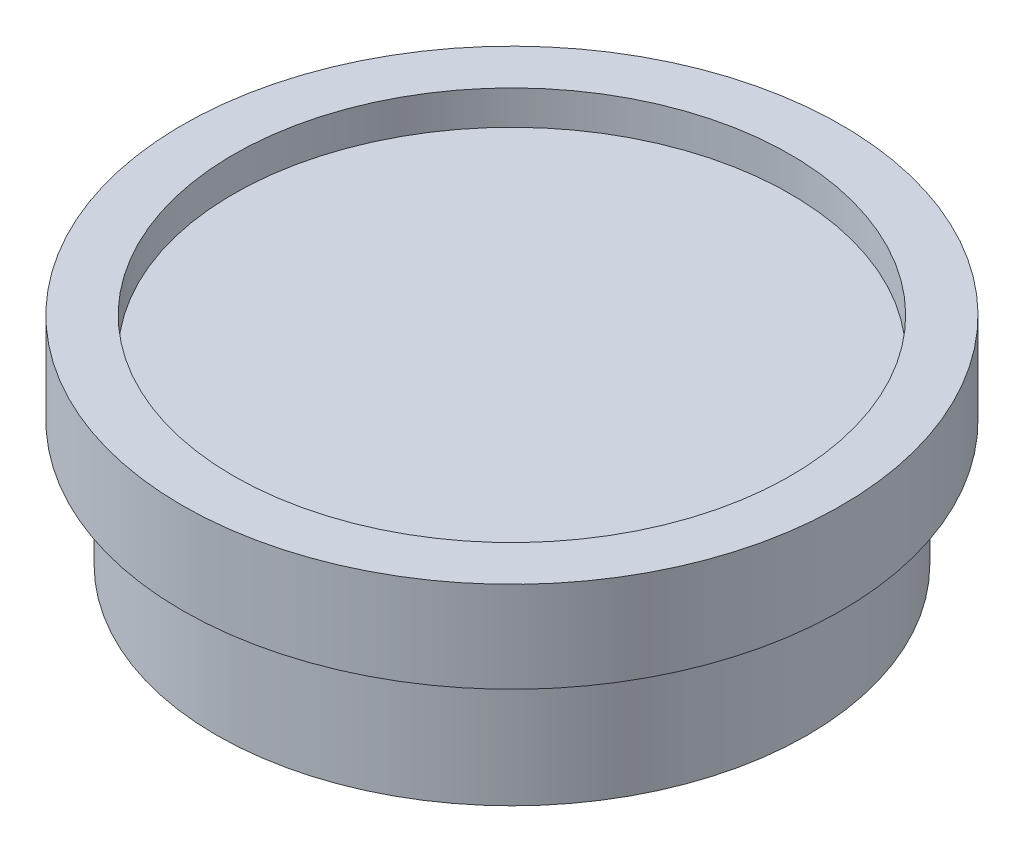
ISO-10303-21;
HEADER;
FILE_DESCRIPTION(('STEP AP214'),'2;1');
FILE_NAME('part.step','',(''),(''),'','','');
FILE_SCHEMA(('AUTOMOTIVE_DESIGN { 1 0 10303 214 1 1 1 1 }'));
ENDSEC;
DATA;
#1=APPLICATION_CONTEXT('core data for automotive mechanical design processes');
#2=APPLICATION_PROTOCOL_DEFINITION('international standard','automotive_design',2000,#1);
#3=PRODUCT_CONTEXT('',#1,'mechanical');
#4=PRODUCT('Part','Part','',(#3));
#5=PRODUCT_RELATED_PRODUCT_CATEGORY('part','',(#4));
#6=PRODUCT_DEFINITION_FORMATION('','',#4);
#7=PRODUCT_DEFINITION_CONTEXT('part definition',#1,'design');
#8=PRODUCT_DEFINITION('design','',#6,#7);
#9=PRODUCT_DEFINITION_SHAPE('','',#8);
#10=(LENGTH_UNIT() NAMED_UNIT(*) SI_UNIT(.MILLI.,.METRE.));
#11=(NAMED_UNIT(*) PLANE_ANGLE_UNIT() SI_UNIT($,.RADIAN.));
#12=(NAMED_UNIT(*) SI_UNIT($,.STERADIAN.) SOLID_ANGLE_UNIT());
#13=UNCERTAINTY_MEASURE_WITH_UNIT(LENGTH_MEASURE(1.E-05),#10,'distance_accuracy_value','');
#14=(GEOMETRIC_REPRESENTATION_CONTEXT(3) GLOBAL_UNCERTAINTY_ASSIGNED_CONTEXT((#13)) GLOBAL_UNIT_ASSIGNED_CONTEXT((#10,
#11,#12)) REPRESENTATION_CONTEXT('',''));
#15=CARTESIAN_POINT('',(0.,0.,0.));
#16=DIRECTION('',(0.,0.,1.));
#17=DIRECTION('',(1.,0.,0.));
#18=AXIS2_PLACEMENT_3D('',#15,#16,#17);
#19=CARTESIAN_POINT('',(0.,-8.,0.));
#20=DIRECTION('',(0.,1.,0.));
#21=DIRECTION('',(0.,0.,1.));
#22=AXIS2_PLACEMENT_3D('',#19,#20,#21);
#23=CYLINDRICAL_SURFACE('',#22,29.);
#24=CARTESIAN_POINT('',(0.,-8.,0.));
#25=DIRECTION('',(0.,1.,0.));
#26=DIRECTION('',(0.,0.,1.));
#27=AXIS2_PLACEMENT_3D('',#24,#25,#26);
#28=CIRCLE('',#27,29.);
#29=CARTESIAN_POINT('',(0.,-8.,29.));
#30=VERTEX_POINT('',#29);
#31=EDGE_CURVE('E41',#30,#30,#28,.T.);
#32=ORIENTED_EDGE('',*,*,#31,.T.);
#33=EDGE_LOOP('',(#32));
#34=FACE_BOUND('',#33,.T.);
#35=CARTESIAN_POINT('',(0.,0.,0.));
#36=DIRECTION('',(0.,1.,0.));
#37=DIRECTION('',(0.,0.,1.));
#38=AXIS2_PLACEMENT_3D('',#35,#36,#37);
#39=CIRCLE('',#38,29.);
#40=CARTESIAN_POINT('',(0.,0.,29.));
#41=VERTEX_POINT('',#40);
#42=EDGE_CURVE('E45',#41,#41,#39,.T.);
#43=ORIENTED_EDGE('',*,*,#42,.F.);
#44=EDGE_LOOP('',(#43));
#45=FACE_BOUND('',#44,.T.);
#46=ADVANCED_FACE('F35',(#34,#45),#23,.T.);
#47=CARTESIAN_POINT('',(0.,-8.,0.));
#48=DIRECTION('',(0.,1.,0.));
#49=DIRECTION('',(0.,0.,1.));
#50=AXIS2_PLACEMENT_3D('',#47,#48,#49);
#51=PLANE('',#50);
#52=CARTESIAN_POINT('',(0.,-8.,0.));
#53=DIRECTION('',(0.,1.,0.));
#54=DIRECTION('',(0.,0.,1.));
#55=AXIS2_PLACEMENT_3D('',#52,#53,#54);
#56=CIRCLE('',#55,26.);
#57=CARTESIAN_POINT('',(0.,-8.,26.));
#58=VERTEX_POINT('',#57);
#59=EDGE_CURVE('E10',#58,#58,#56,.F.);
#60=ORIENTED_EDGE('',*,*,#59,.F.);
#61=EDGE_LOOP('',(#60));
#62=FACE_BOUND('',#61,.T.);
#63=ORIENTED_EDGE('',*,*,#31,.F.);
#64=EDGE_LOOP('',(#63));
#65=FACE_BOUND('',#64,.T.);
#66=ADVANCED_FACE('F74',(#62,#65),#51,.F.);
#67=CARTESIAN_POINT('',(0.,0.,0.));
#68=DIRECTION('',(0.,1.,0.));
#69=DIRECTION('',(0.,0.,1.));
#70=AXIS2_PLACEMENT_3D('',#67,#68,#69);
#71=PLANE('',#70);
#72=CARTESIAN_POINT('',(0.,0.,0.));
#73=DIRECTION('',(0.,1.,0.));
#74=DIRECTION('',(0.,0.,1.));
#75=AXIS2_PLACEMENT_3D('',#72,#73,#74);
#76=CIRCLE('',#75,24.5);
#77=CARTESIAN_POINT('',(0.,0.,24.5));
#78=VERTEX_POINT('',#77);
#79=EDGE_CURVE('E55',#78,#78,#76,.T.);
#80=ORIENTED_EDGE('',*,*,#79,.F.);
#81=EDGE_LOOP('',(#80));
#82=FACE_BOUND('',#81,.T.);
#83=ORIENTED_EDGE('',*,*,#42,.T.);
#84=EDGE_LOOP('',(#83));
#85=FACE_BOUND('',#84,.T.);
#86=ADVANCED_FACE('F70',(#82,#85),#71,.T.);
#87=CARTESIAN_POINT('',(0.,-19.,0.));
#88=DIRECTION('',(0.,1.,0.));
#89=DIRECTION('',(0.,0.,1.));
#90=AXIS2_PLACEMENT_3D('',#87,#88,#89);
#91=CYLINDRICAL_SURFACE('',#90,26.);
#92=CARTESIAN_POINT('',(0.,-19.,0.));
#93=DIRECTION('',(0.,-1.,0.));
#94=DIRECTION('',(0.,0.,-1.));
#95=AXIS2_PLACEMENT_3D('',#92,#93,#94);
#96=CIRCLE('',#95,26.);
#97=CARTESIAN_POINT('',(0.,-19.,-26.));
#98=VERTEX_POINT('',#97);
#99=EDGE_CURVE('E50',#98,#98,#96,.T.);
#100=ORIENTED_EDGE('',*,*,#99,.F.);
#101=EDGE_LOOP('',(#100));
#102=FACE_BOUND('',#101,.T.);
#103=ORIENTED_EDGE('',*,*,#59,.T.);
#104=EDGE_LOOP('',(#103));
#105=FACE_BOUND('',#104,.T.);
#106=ADVANCED_FACE('F73',(#102,#105),#91,.T.);
#107=CARTESIAN_POINT('',(0.,-19.,0.));
#108=DIRECTION('',(0.,-1.,0.));
#109=DIRECTION('',(0.,0.,-1.));
#110=AXIS2_PLACEMENT_3D('',#107,#108,#109);
#111=PLANE('',#110);
#112=ORIENTED_EDGE('',*,*,#99,.T.);
#113=EDGE_LOOP('',(#112));
#114=FACE_BOUND('',#113,.T.);
#115=ADVANCED_FACE('F66',(#114),#111,.T.);
#116=CARTESIAN_POINT('',(0.,-3.,0.));
#117=DIRECTION('',(0.,1.,0.));
#118=DIRECTION('',(0.,0.,1.));
#119=AXIS2_PLACEMENT_3D('',#116,#117,#118);
#120=CYLINDRICAL_SURFACE('',#119,24.5);
#121=CARTESIAN_POINT('',(0.,-3.,0.));
#122=DIRECTION('',(0.,1.,0.));
#123=DIRECTION('',(0.,0.,1.));
#124=AXIS2_PLACEMENT_3D('',#121,#122,#123);
#125=CIRCLE('',#124,24.5);
#126=CARTESIAN_POINT('',(0.,-3.,24.5));
#127=VERTEX_POINT('',#126);
#128=EDGE_CURVE('E54',#127,#127,#125,.T.);
#129=ORIENTED_EDGE('',*,*,#128,.F.);
#130=EDGE_LOOP('',(#129));
#131=FACE_BOUND('',#130,.T.);
#132=ORIENTED_EDGE('',*,*,#79,.T.);
#133=EDGE_LOOP('',(#132));
#134=FACE_BOUND('',#133,.T.);
#135=ADVANCED_FACE('F63',(#131,#134),#120,.F.);
#136=CARTESIAN_POINT('',(0.,-3.,0.));
#137=DIRECTION('',(0.,1.,0.));
#138=DIRECTION('',(0.,0.,1.));
#139=AXIS2_PLACEMENT_3D('',#136,#137,#138);
#140=PLANE('',#139);
#141=ORIENTED_EDGE('',*,*,#128,.T.);
#142=EDGE_LOOP('',(#141));
#143=FACE_BOUND('',#142,.T.);
#144=ADVANCED_FACE('F61',(#143),#140,.T.);
#145=CLOSED_SHELL('',(#46,#66,#86,#106,#115,#135,#144));
#146=MANIFOLD_SOLID_BREP('B2',#145);
#147=ADVANCED_BREP_SHAPE_REPRESENTATION('',(#18,#146),#14);
#148=SHAPE_DEFINITION_REPRESENTATION(#9,#147);
ENDSEC;
END-ISO-10303-21;
